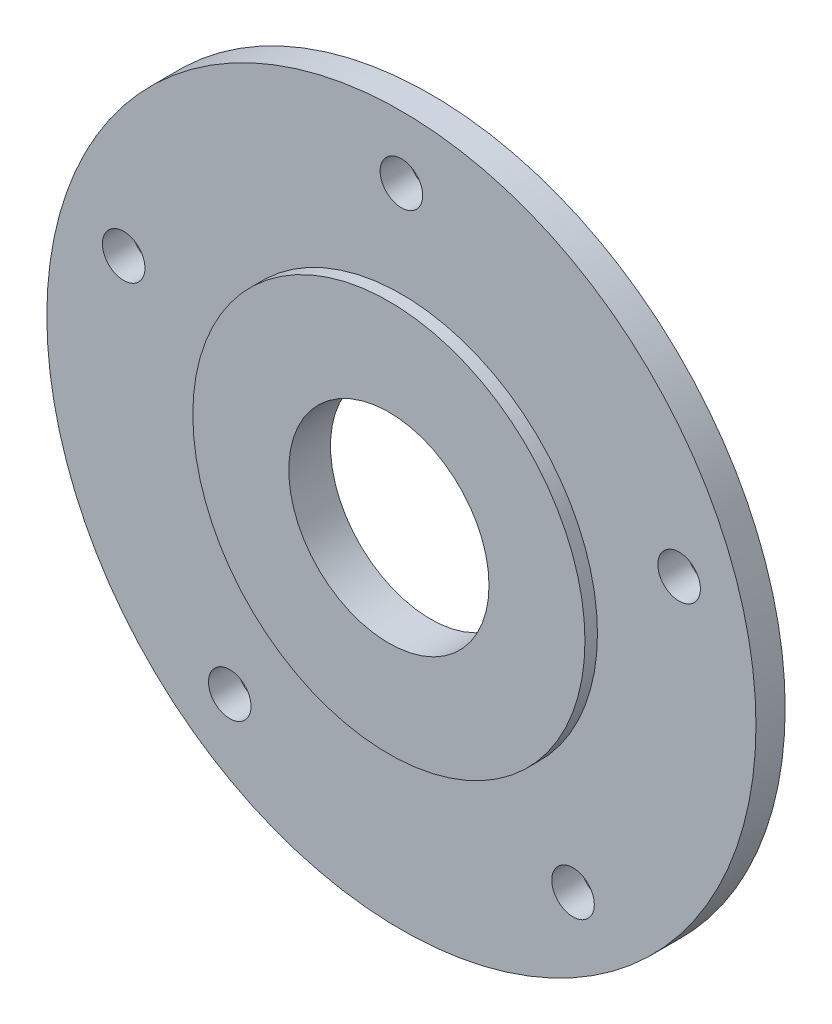
ISO-10303-21;
HEADER;
FILE_DESCRIPTION(('STEP AP214'),'2;1');
FILE_NAME('part.step','',(''),(''),'','','');
FILE_SCHEMA(('AUTOMOTIVE_DESIGN { 1 0 10303 214 1 1 1 1 }'));
ENDSEC;
DATA;
#1=APPLICATION_CONTEXT('core data for automotive mechanical design processes');
#2=APPLICATION_PROTOCOL_DEFINITION('international standard','automotive_design',2000,#1);
#3=PRODUCT_CONTEXT('',#1,'mechanical');
#4=PRODUCT('Part','Part','',(#3));
#5=PRODUCT_RELATED_PRODUCT_CATEGORY('part','',(#4));
#6=PRODUCT_DEFINITION_FORMATION('','',#4);
#7=PRODUCT_DEFINITION_CONTEXT('part definition',#1,'design');
#8=PRODUCT_DEFINITION('design','',#6,#7);
#9=PRODUCT_DEFINITION_SHAPE('','',#8);
#10=(LENGTH_UNIT() NAMED_UNIT(*) SI_UNIT(.MILLI.,.METRE.));
#11=(NAMED_UNIT(*) PLANE_ANGLE_UNIT() SI_UNIT($,.RADIAN.));
#12=(NAMED_UNIT(*) SI_UNIT($,.STERADIAN.) SOLID_ANGLE_UNIT());
#13=UNCERTAINTY_MEASURE_WITH_UNIT(LENGTH_MEASURE(1.E-05),#10,'distance_accuracy_value','');
#14=(GEOMETRIC_REPRESENTATION_CONTEXT(3) GLOBAL_UNCERTAINTY_ASSIGNED_CONTEXT((#13)) GLOBAL_UNIT_ASSIGNED_CONTEXT((#10,
#11,#12)) REPRESENTATION_CONTEXT('',''));
#15=CARTESIAN_POINT('',(0.,0.,0.));
#16=DIRECTION('',(0.,0.,1.));
#17=DIRECTION('',(1.,0.,0.));
#18=AXIS2_PLACEMENT_3D('',#15,#16,#17);
#19=CARTESIAN_POINT('',(0.,0.,75.));
#20=DIRECTION('',(0.,0.,1.));
#21=DIRECTION('',(1.,0.,0.));
#22=AXIS2_PLACEMENT_3D('',#19,#20,#21);
#23=PLANE('',#22);
#24=CARTESIAN_POINT('',(0.,0.,75.));
#25=DIRECTION('',(0.,0.,1.));
#26=DIRECTION('',(1.,0.,0.));
#27=AXIS2_PLACEMENT_3D('',#24,#25,#26);
#28=CIRCLE('',#27,24.);
#29=CARTESIAN_POINT('',(24.,0.,75.));
#30=VERTEX_POINT('',#29);
#31=EDGE_CURVE('E42',#30,#30,#28,.T.);
#32=ORIENTED_EDGE('',*,*,#31,.F.);
#33=EDGE_LOOP('',(#32));
#34=FACE_BOUND('',#33,.T.);
#35=CARTESIAN_POINT('',(0.,0.,75.));
#36=DIRECTION('',(0.,0.,1.));
#37=DIRECTION('',(1.,0.,0.));
#38=AXIS2_PLACEMENT_3D('',#35,#36,#37);
#39=CIRCLE('',#38,47.);
#40=CARTESIAN_POINT('',(47.,0.,75.));
#41=VERTEX_POINT('',#40);
#42=EDGE_CURVE('E51',#41,#41,#39,.T.);
#43=ORIENTED_EDGE('',*,*,#42,.T.);
#44=EDGE_LOOP('',(#43));
#45=FACE_BOUND('',#44,.T.);
#46=ADVANCED_FACE('F34',(#34,#45),#23,.T.);
#47=CARTESIAN_POINT('',(0.,0.,75.));
#48=DIRECTION('',(0.,0.,-1.));
#49=DIRECTION('',(-1.,0.,0.));
#50=AXIS2_PLACEMENT_3D('',#47,#48,#49);
#51=CYLINDRICAL_SURFACE('',#50,85.);
#52=CARTESIAN_POINT('',(0.,0.,65.));
#53=DIRECTION('',(0.,0.,1.));
#54=DIRECTION('',(1.,0.,0.));
#55=AXIS2_PLACEMENT_3D('',#52,#53,#54);
#56=CIRCLE('',#55,85.);
#57=CARTESIAN_POINT('',(85.,0.,65.));
#58=VERTEX_POINT('',#57);
#59=EDGE_CURVE('E10',#58,#58,#56,.T.);
#60=ORIENTED_EDGE('',*,*,#59,.T.);
#61=EDGE_LOOP('',(#60));
#62=FACE_BOUND('',#61,.T.);
#63=CARTESIAN_POINT('',(0.,0.,72.));
#64=DIRECTION('',(0.,0.,1.));
#65=DIRECTION('',(1.,0.,0.));
#66=AXIS2_PLACEMENT_3D('',#63,#64,#65);
#67=CIRCLE('',#66,85.);
#68=CARTESIAN_POINT('',(85.,0.,72.));
#69=VERTEX_POINT('',#68);
#70=EDGE_CURVE('E38',#69,#69,#67,.T.);
#71=ORIENTED_EDGE('',*,*,#70,.F.);
#72=EDGE_LOOP('',(#71));
#73=FACE_BOUND('',#72,.T.);
#74=ADVANCED_FACE('F36',(#62,#73),#51,.T.);
#75=CARTESIAN_POINT('',(0.,0.,65.));
#76=DIRECTION('',(0.,0.,1.));
#77=DIRECTION('',(1.,0.,0.));
#78=AXIS2_PLACEMENT_3D('',#75,#76,#77);
#79=PLANE('',#78);
#80=CARTESIAN_POINT('',(0.,70.,65.));
#81=DIRECTION('',(0.,0.,1.));
#82=DIRECTION('',(1.,0.,0.));
#83=AXIS2_PLACEMENT_3D('',#80,#81,#82);
#84=CIRCLE('',#83,5.1);
#85=CARTESIAN_POINT('',(5.1,70.,65.));
#86=VERTEX_POINT('',#85);
#87=EDGE_CURVE('E81',#86,#86,#84,.T.);
#88=ORIENTED_EDGE('',*,*,#87,.T.);
#89=EDGE_LOOP('',(#88));
#90=FACE_BOUND('',#89,.T.);
#91=CARTESIAN_POINT('',(-66.5739561406605,21.6311896062471,65.));
#92=DIRECTION('',(0.,0.,1.));
#93=DIRECTION('',(1.,0.,0.));
#94=AXIS2_PLACEMENT_3D('',#91,#92,#93);
#95=CIRCLE('',#94,5.1);
#96=CARTESIAN_POINT('',(-61.4739561406605,21.6311896062471,65.));
#97=VERTEX_POINT('',#96);
#98=EDGE_CURVE('E75',#97,#97,#95,.T.);
#99=ORIENTED_EDGE('',*,*,#98,.T.);
#100=EDGE_LOOP('',(#99));
#101=FACE_BOUND('',#100,.T.);
#102=CARTESIAN_POINT('',(-41.1449676604736,-56.631189606246,65.));
#103=DIRECTION('',(0.,0.,1.));
#104=DIRECTION('',(1.,0.,0.));
#105=AXIS2_PLACEMENT_3D('',#102,#103,#104);
#106=CIRCLE('',#105,5.1);
#107=CARTESIAN_POINT('',(-36.0449676604736,-56.631189606246,65.));
#108=VERTEX_POINT('',#107);
#109=EDGE_CURVE('E69',#108,#108,#106,.T.);
#110=ORIENTED_EDGE('',*,*,#109,.T.);
#111=EDGE_LOOP('',(#110));
#112=FACE_BOUND('',#111,.T.);
#113=CARTESIAN_POINT('',(41.1449676604728,-56.6311896062466,65.));
#114=DIRECTION('',(0.,0.,1.));
#115=DIRECTION('',(1.,0.,0.));
#116=AXIS2_PLACEMENT_3D('',#113,#114,#115);
#117=CIRCLE('',#116,5.1);
#118=CARTESIAN_POINT('',(46.2449676604728,-56.6311896062466,65.));
#119=VERTEX_POINT('',#118);
#120=EDGE_CURVE('E63',#119,#119,#117,.T.);
#121=ORIENTED_EDGE('',*,*,#120,.T.);
#122=EDGE_LOOP('',(#121));
#123=FACE_BOUND('',#122,.T.);
#124=CARTESIAN_POINT('',(66.5739561406608,21.6311896062461,65.));
#125=DIRECTION('',(0.,0.,1.));
#126=DIRECTION('',(1.,0.,0.));
#127=AXIS2_PLACEMENT_3D('',#124,#125,#126);
#128=CIRCLE('',#127,5.09999999999999);
#129=CARTESIAN_POINT('',(71.6739561406608,21.6311896062461,65.));
#130=VERTEX_POINT('',#129);
#131=EDGE_CURVE('E55',#130,#130,#128,.T.);
#132=ORIENTED_EDGE('',*,*,#131,.T.);
#133=EDGE_LOOP('',(#132));
#134=FACE_BOUND('',#133,.T.);
#135=ORIENTED_EDGE('',*,*,#59,.F.);
#136=EDGE_LOOP('',(#135));
#137=FACE_BOUND('',#136,.T.);
#138=CARTESIAN_POINT('',(0.,0.,65.));
#139=DIRECTION('',(0.,0.,1.));
#140=DIRECTION('',(1.,0.,0.));
#141=AXIS2_PLACEMENT_3D('',#138,#139,#140);
#142=CIRCLE('',#141,24.);
#143=CARTESIAN_POINT('',(24.,0.,65.));
#144=VERTEX_POINT('',#143);
#145=EDGE_CURVE('E46',#144,#144,#142,.T.);
#146=ORIENTED_EDGE('',*,*,#145,.T.);
#147=EDGE_LOOP('',(#146));
#148=FACE_BOUND('',#147,.T.);
#149=ADVANCED_FACE('F110',(#90,#101,#112,#123,#134,#137,#148),#79,.F.);
#150=CARTESIAN_POINT('',(0.,0.,75.));
#151=DIRECTION('',(0.,0.,-1.));
#152=DIRECTION('',(-1.,0.,0.));
#153=AXIS2_PLACEMENT_3D('',#150,#151,#152);
#154=CYLINDRICAL_SURFACE('',#153,24.);
#155=ORIENTED_EDGE('',*,*,#31,.T.);
#156=EDGE_LOOP('',(#155));
#157=FACE_BOUND('',#156,.T.);
#158=ORIENTED_EDGE('',*,*,#145,.F.);
#159=EDGE_LOOP('',(#158));
#160=FACE_BOUND('',#159,.T.);
#161=ADVANCED_FACE('F94',(#157,#160),#154,.F.);
#162=CARTESIAN_POINT('',(0.,0.,72.));
#163=DIRECTION('',(0.,0.,1.));
#164=DIRECTION('',(1.,0.,0.));
#165=AXIS2_PLACEMENT_3D('',#162,#163,#164);
#166=PLANE('',#165);
#167=CARTESIAN_POINT('',(0.,70.,72.));
#168=DIRECTION('',(0.,0.,1.));
#169=DIRECTION('',(1.,0.,0.));
#170=AXIS2_PLACEMENT_3D('',#167,#168,#169);
#171=CIRCLE('',#170,5.09999999999999);
#172=CARTESIAN_POINT('',(5.09999999999999,70.,72.));
#173=VERTEX_POINT('',#172);
#174=EDGE_CURVE('E84',#173,#173,#171,.T.);
#175=ORIENTED_EDGE('',*,*,#174,.F.);
#176=EDGE_LOOP('',(#175));
#177=FACE_BOUND('',#176,.T.);
#178=CARTESIAN_POINT('',(-66.5739561406605,21.6311896062471,72.));
#179=DIRECTION('',(0.,0.,1.));
#180=DIRECTION('',(1.,0.,0.));
#181=AXIS2_PLACEMENT_3D('',#178,#179,#180);
#182=CIRCLE('',#181,5.09999999999999);
#183=CARTESIAN_POINT('',(-61.4739561406605,21.6311896062471,72.));
#184=VERTEX_POINT('',#183);
#185=EDGE_CURVE('E78',#184,#184,#182,.T.);
#186=ORIENTED_EDGE('',*,*,#185,.F.);
#187=EDGE_LOOP('',(#186));
#188=FACE_BOUND('',#187,.T.);
#189=CARTESIAN_POINT('',(-41.1449676604736,-56.631189606246,72.));
#190=DIRECTION('',(0.,0.,1.));
#191=DIRECTION('',(1.,0.,0.));
#192=AXIS2_PLACEMENT_3D('',#189,#190,#191);
#193=CIRCLE('',#192,5.09999999999999);
#194=CARTESIAN_POINT('',(-36.0449676604736,-56.631189606246,72.));
#195=VERTEX_POINT('',#194);
#196=EDGE_CURVE('E72',#195,#195,#193,.T.);
#197=ORIENTED_EDGE('',*,*,#196,.F.);
#198=EDGE_LOOP('',(#197));
#199=FACE_BOUND('',#198,.T.);
#200=CARTESIAN_POINT('',(41.1449676604728,-56.6311896062466,72.));
#201=DIRECTION('',(0.,0.,1.));
#202=DIRECTION('',(1.,0.,0.));
#203=AXIS2_PLACEMENT_3D('',#200,#201,#202);
#204=CIRCLE('',#203,5.09999999999999);
#205=CARTESIAN_POINT('',(46.2449676604728,-56.6311896062466,72.));
#206=VERTEX_POINT('',#205);
#207=EDGE_CURVE('E66',#206,#206,#204,.T.);
#208=ORIENTED_EDGE('',*,*,#207,.F.);
#209=EDGE_LOOP('',(#208));
#210=FACE_BOUND('',#209,.T.);
#211=CARTESIAN_POINT('',(66.5739561406608,21.6311896062461,72.));
#212=DIRECTION('',(0.,0.,1.));
#213=DIRECTION('',(1.,0.,0.));
#214=AXIS2_PLACEMENT_3D('',#211,#212,#213);
#215=CIRCLE('',#214,5.09999999999999);
#216=CARTESIAN_POINT('',(71.6739561406608,21.6311896062461,72.));
#217=VERTEX_POINT('',#216);
#218=EDGE_CURVE('E60',#217,#217,#215,.T.);
#219=ORIENTED_EDGE('',*,*,#218,.F.);
#220=EDGE_LOOP('',(#219));
#221=FACE_BOUND('',#220,.T.);
#222=CARTESIAN_POINT('',(0.,0.,72.));
#223=DIRECTION('',(0.,0.,1.));
#224=DIRECTION('',(1.,0.,0.));
#225=AXIS2_PLACEMENT_3D('',#222,#223,#224);
#226=CIRCLE('',#225,47.);
#227=CARTESIAN_POINT('',(47.,0.,72.));
#228=VERTEX_POINT('',#227);
#229=EDGE_CURVE('E54',#228,#228,#226,.T.);
#230=ORIENTED_EDGE('',*,*,#229,.F.);
#231=EDGE_LOOP('',(#230));
#232=FACE_BOUND('',#231,.T.);
#233=ORIENTED_EDGE('',*,*,#70,.T.);
#234=EDGE_LOOP('',(#233));
#235=FACE_BOUND('',#234,.T.);
#236=ADVANCED_FACE('F90',(#177,#188,#199,#210,#221,#232,#235),#166,.T.);
#237=CARTESIAN_POINT('',(0.,0.,72.));
#238=DIRECTION('',(0.,0.,1.));
#239=DIRECTION('',(1.,0.,0.));
#240=AXIS2_PLACEMENT_3D('',#237,#238,#239);
#241=CYLINDRICAL_SURFACE('',#240,47.);
#242=ORIENTED_EDGE('',*,*,#229,.T.);
#243=EDGE_LOOP('',(#242));
#244=FACE_BOUND('',#243,.T.);
#245=ORIENTED_EDGE('',*,*,#42,.F.);
#246=EDGE_LOOP('',(#245));
#247=FACE_BOUND('',#246,.T.);
#248=ADVANCED_FACE('F93',(#244,#247),#241,.T.);
#249=CARTESIAN_POINT('',(66.5739561406608,21.6311896062461,72.));
#250=DIRECTION('',(0.,0.,1.));
#251=DIRECTION('',(1.,0.,0.));
#252=AXIS2_PLACEMENT_3D('',#249,#250,#251);
#253=CYLINDRICAL_SURFACE('',#252,5.09999999999999);
#254=ORIENTED_EDGE('',*,*,#131,.F.);
#255=EDGE_LOOP('',(#254));
#256=FACE_BOUND('',#255,.T.);
#257=ORIENTED_EDGE('',*,*,#218,.T.);
#258=EDGE_LOOP('',(#257));
#259=FACE_BOUND('',#258,.T.);
#260=ADVANCED_FACE('F128',(#256,#259),#253,.F.);
#261=CARTESIAN_POINT('',(41.1449676604728,-56.6311896062466,72.));
#262=DIRECTION('',(0.,0.,1.));
#263=DIRECTION('',(1.,0.,0.));
#264=AXIS2_PLACEMENT_3D('',#261,#262,#263);
#265=CYLINDRICAL_SURFACE('',#264,5.1);
#266=ORIENTED_EDGE('',*,*,#120,.F.);
#267=EDGE_LOOP('',(#266));
#268=FACE_BOUND('',#267,.T.);
#269=ORIENTED_EDGE('',*,*,#207,.T.);
#270=EDGE_LOOP('',(#269));
#271=FACE_BOUND('',#270,.T.);
#272=ADVANCED_FACE('F132',(#268,#271),#265,.F.);
#273=CARTESIAN_POINT('',(-41.1449676604736,-56.631189606246,72.));
#274=DIRECTION('',(0.,0.,1.));
#275=DIRECTION('',(1.,0.,0.));
#276=AXIS2_PLACEMENT_3D('',#273,#274,#275);
#277=CYLINDRICAL_SURFACE('',#276,5.1);
#278=ORIENTED_EDGE('',*,*,#109,.F.);
#279=EDGE_LOOP('',(#278));
#280=FACE_BOUND('',#279,.T.);
#281=ORIENTED_EDGE('',*,*,#196,.T.);
#282=EDGE_LOOP('',(#281));
#283=FACE_BOUND('',#282,.T.);
#284=ADVANCED_FACE('F136',(#280,#283),#277,.F.);
#285=CARTESIAN_POINT('',(-66.5739561406605,21.6311896062471,72.));
#286=DIRECTION('',(0.,0.,1.));
#287=DIRECTION('',(1.,0.,0.));
#288=AXIS2_PLACEMENT_3D('',#285,#286,#287);
#289=CYLINDRICAL_SURFACE('',#288,5.1);
#290=ORIENTED_EDGE('',*,*,#98,.F.);
#291=EDGE_LOOP('',(#290));
#292=FACE_BOUND('',#291,.T.);
#293=ORIENTED_EDGE('',*,*,#185,.T.);
#294=EDGE_LOOP('',(#293));
#295=FACE_BOUND('',#294,.T.);
#296=ADVANCED_FACE('F140',(#292,#295),#289,.F.);
#297=CARTESIAN_POINT('',(0.,70.,72.));
#298=DIRECTION('',(0.,0.,1.));
#299=DIRECTION('',(1.,0.,0.));
#300=AXIS2_PLACEMENT_3D('',#297,#298,#299);
#301=CYLINDRICAL_SURFACE('',#300,5.1);
#302=ORIENTED_EDGE('',*,*,#87,.F.);
#303=EDGE_LOOP('',(#302));
#304=FACE_BOUND('',#303,.T.);
#305=ORIENTED_EDGE('',*,*,#174,.T.);
#306=EDGE_LOOP('',(#305));
#307=FACE_BOUND('',#306,.T.);
#308=ADVANCED_FACE('F88',(#304,#307),#301,.F.);
#309=CLOSED_SHELL('',(#46,#74,#149,#161,#236,#248,#260,#272,#284,#296,#308));
#310=MANIFOLD_SOLID_BREP('B2',#309);
#311=ADVANCED_BREP_SHAPE_REPRESENTATION('',(#18,#310),#14);
#312=SHAPE_DEFINITION_REPRESENTATION(#9,#311);
ENDSEC;
END-ISO-10303-21;
